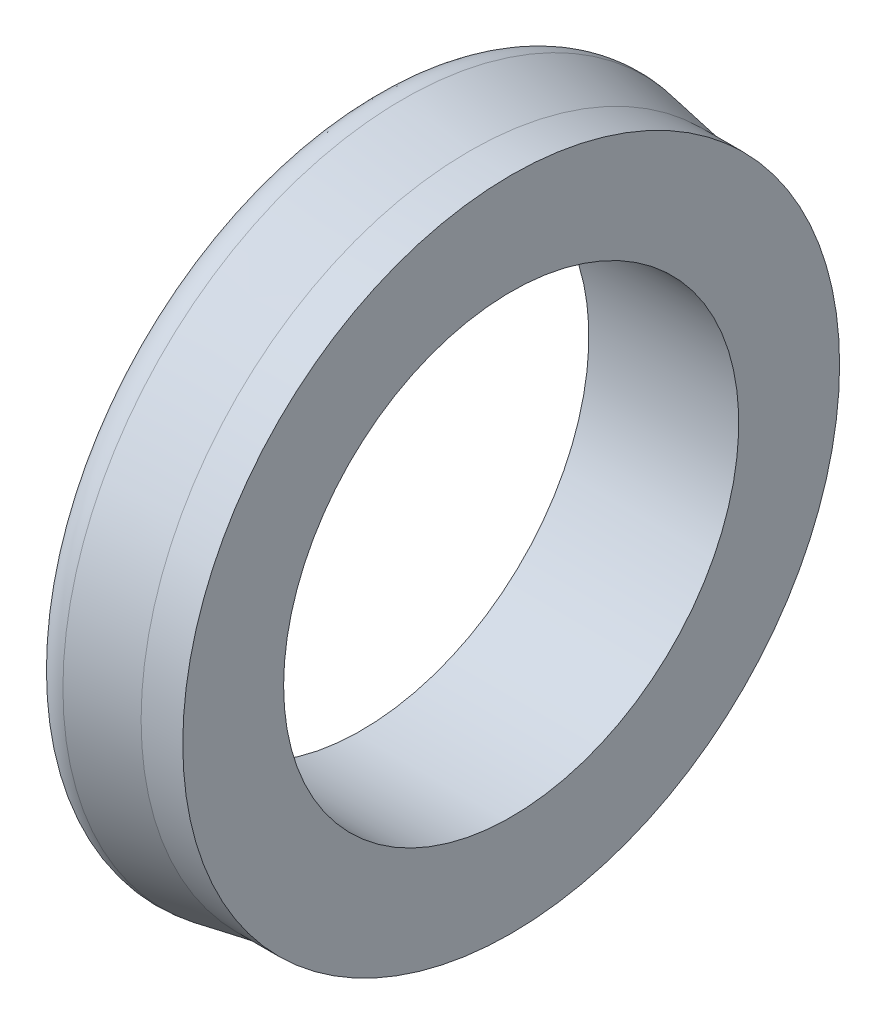
ISO-10303-21;
HEADER;
FILE_DESCRIPTION(('STEP AP214'),'2;1');
FILE_NAME('part.step','',(''),(''),'','','');
FILE_SCHEMA(('AUTOMOTIVE_DESIGN { 1 0 10303 214 1 1 1 1 }'));
ENDSEC;
DATA;
#1=APPLICATION_CONTEXT('core data for automotive mechanical design processes');
#2=APPLICATION_PROTOCOL_DEFINITION('international standard','automotive_design',2000,#1);
#3=PRODUCT_CONTEXT('',#1,'mechanical');
#4=PRODUCT('Part','Part','',(#3));
#5=PRODUCT_RELATED_PRODUCT_CATEGORY('part','',(#4));
#6=PRODUCT_DEFINITION_FORMATION('','',#4);
#7=PRODUCT_DEFINITION_CONTEXT('part definition',#1,'design');
#8=PRODUCT_DEFINITION('design','',#6,#7);
#9=PRODUCT_DEFINITION_SHAPE('','',#8);
#10=(LENGTH_UNIT() NAMED_UNIT(*) SI_UNIT(.MILLI.,.METRE.));
#11=(NAMED_UNIT(*) PLANE_ANGLE_UNIT() SI_UNIT($,.RADIAN.));
#12=(NAMED_UNIT(*) SI_UNIT($,.STERADIAN.) SOLID_ANGLE_UNIT());
#13=UNCERTAINTY_MEASURE_WITH_UNIT(LENGTH_MEASURE(1.E-05),#10,'distance_accuracy_value','');
#14=(GEOMETRIC_REPRESENTATION_CONTEXT(3) GLOBAL_UNCERTAINTY_ASSIGNED_CONTEXT((#13)) GLOBAL_UNIT_ASSIGNED_CONTEXT((#10,
#11,#12)) REPRESENTATION_CONTEXT('',''));
#15=CARTESIAN_POINT('',(0.,0.,0.));
#16=DIRECTION('',(0.,0.,1.));
#17=DIRECTION('',(1.,0.,0.));
#18=AXIS2_PLACEMENT_3D('',#15,#16,#17);
#19=CARTESIAN_POINT('',(0.,8.35,0.));
#20=DIRECTION('',(1.,0.,0.));
#21=DIRECTION('',(0.,0.,-1.));
#22=AXIS2_PLACEMENT_3D('',#19,#20,#21);
#23=PLANE('',#22);
#24=CARTESIAN_POINT('',(0.,0.,0.));
#25=DIRECTION('',(-1.,0.,0.));
#26=DIRECTION('',(0.,0.,1.));
#27=AXIS2_PLACEMENT_3D('',#24,#25,#26);
#28=CIRCLE('',#27,8.35);
#29=CARTESIAN_POINT('',(0.,0.,8.35));
#30=VERTEX_POINT('',#29);
#31=EDGE_CURVE('E10',#30,#30,#28,.T.);
#32=ORIENTED_EDGE('',*,*,#31,.F.);
#33=EDGE_LOOP('',(#32));
#34=FACE_BOUND('',#33,.T.);
#35=CARTESIAN_POINT('',(0.,0.,0.));
#36=DIRECTION('',(-1.,0.,0.));
#37=DIRECTION('',(0.,0.,1.));
#38=AXIS2_PLACEMENT_3D('',#35,#36,#37);
#39=CIRCLE('',#38,10.15);
#40=CARTESIAN_POINT('',(0.,0.,10.15));
#41=VERTEX_POINT('',#40);
#42=EDGE_CURVE('E62',#41,#41,#39,.T.);
#43=ORIENTED_EDGE('',*,*,#42,.T.);
#44=EDGE_LOOP('',(#43));
#45=FACE_BOUND('',#44,.T.);
#46=ADVANCED_FACE('F28',(#34,#45),#23,.F.);
#47=CARTESIAN_POINT('',(-5.,0.,0.));
#48=DIRECTION('',(-1.,0.,0.));
#49=DIRECTION('',(0.,0.,1.));
#50=AXIS2_PLACEMENT_3D('',#47,#48,#49);
#51=CYLINDRICAL_SURFACE('',#50,8.35);
#52=CARTESIAN_POINT('',(5.5,0.,0.));
#53=DIRECTION('',(-1.,0.,0.));
#54=DIRECTION('',(0.,0.,1.));
#55=AXIS2_PLACEMENT_3D('',#52,#53,#54);
#56=CIRCLE('',#55,8.35);
#57=CARTESIAN_POINT('',(5.5,0.,8.35));
#58=VERTEX_POINT('',#57);
#59=EDGE_CURVE('E34',#58,#58,#56,.T.);
#60=ORIENTED_EDGE('',*,*,#59,.F.);
#61=EDGE_LOOP('',(#60));
#62=FACE_BOUND('',#61,.T.);
#63=ORIENTED_EDGE('',*,*,#31,.T.);
#64=EDGE_LOOP('',(#63));
#65=FACE_BOUND('',#64,.T.);
#66=ADVANCED_FACE('F111',(#62,#65),#51,.F.);
#67=CARTESIAN_POINT('',(5.5,8.35,0.));
#68=DIRECTION('',(-1.,0.,0.));
#69=DIRECTION('',(0.,0.,1.));
#70=AXIS2_PLACEMENT_3D('',#67,#68,#69);
#71=PLANE('',#70);
#72=CARTESIAN_POINT('',(5.5,0.,0.));
#73=DIRECTION('',(-1.,0.,0.));
#74=DIRECTION('',(0.,0.,1.));
#75=AXIS2_PLACEMENT_3D('',#72,#73,#74);
#76=CIRCLE('',#75,12.05);
#77=CARTESIAN_POINT('',(5.5,0.,12.05));
#78=VERTEX_POINT('',#77);
#79=EDGE_CURVE('E38',#78,#78,#76,.T.);
#80=ORIENTED_EDGE('',*,*,#79,.F.);
#81=EDGE_LOOP('',(#80));
#82=FACE_BOUND('',#81,.T.);
#83=ORIENTED_EDGE('',*,*,#59,.T.);
#84=EDGE_LOOP('',(#83));
#85=FACE_BOUND('',#84,.T.);
#86=ADVANCED_FACE('F106',(#82,#85),#71,.F.);
#87=CARTESIAN_POINT('',(-5.,0.,0.));
#88=DIRECTION('',(-1.,0.,0.));
#89=DIRECTION('',(0.,0.,1.));
#90=AXIS2_PLACEMENT_3D('',#87,#88,#89);
#91=CYLINDRICAL_SURFACE('',#90,12.05);
#92=CARTESIAN_POINT('',(3.97133627049761,0.,0.));
#93=DIRECTION('',(-1.,0.,0.));
#94=DIRECTION('',(0.,0.,1.));
#95=AXIS2_PLACEMENT_3D('',#92,#93,#94);
#96=CIRCLE('',#95,12.05);
#97=CARTESIAN_POINT('',(3.97133627049761,0.,12.05));
#98=VERTEX_POINT('',#97);
#99=EDGE_CURVE('E42',#98,#98,#96,.T.);
#100=ORIENTED_EDGE('',*,*,#99,.F.);
#101=EDGE_LOOP('',(#100));
#102=FACE_BOUND('',#101,.T.);
#103=ORIENTED_EDGE('',*,*,#79,.T.);
#104=EDGE_LOOP('',(#103));
#105=FACE_BOUND('',#104,.T.);
#106=ADVANCED_FACE('F100',(#102,#105),#91,.T.);
#107=CARTESIAN_POINT('',(3.97133627049761,0.,0.));
#108=DIRECTION('',(-1.,0.,0.));
#109=DIRECTION('',(0.,0.,1.));
#110=AXIS2_PLACEMENT_3D('',#107,#108,#109);
#111=CONICAL_SURFACE('',#110,12.05,0.176576889836121);
#112=CARTESIAN_POINT('',(1.53655532192728,0.,0.));
#113=DIRECTION('',(-1.,0.,0.));
#114=DIRECTION('',(0.,0.,1.));
#115=AXIS2_PLACEMENT_3D('',#112,#113,#114);
#116=CIRCLE('',#115,12.484450765365);
#117=CARTESIAN_POINT('',(1.53655532192728,0.,12.484450765365));
#118=VERTEX_POINT('',#117);
#119=EDGE_CURVE('E47',#118,#118,#116,.T.);
#120=ORIENTED_EDGE('',*,*,#119,.F.);
#121=EDGE_LOOP('',(#120));
#122=FACE_BOUND('',#121,.T.);
#123=ORIENTED_EDGE('',*,*,#99,.T.);
#124=EDGE_LOOP('',(#123));
#125=FACE_BOUND('',#124,.T.);
#126=ADVANCED_FACE('F94',(#122,#125),#111,.T.);
#127=CARTESIAN_POINT('',(1.36089459617366,0.,0.));
#128=DIRECTION('',(-1.,0.,0.));
#129=DIRECTION('',(0.,0.,1.));
#130=AXIS2_PLACEMENT_3D('',#127,#128,#129);
#131=TOROIDAL_SURFACE('',#130,11.5,1.);
#132=CARTESIAN_POINT('',(0.599999999999999,0.,0.));
#133=DIRECTION('',(-1.,0.,0.));
#134=DIRECTION('',(0.,0.,1.));
#135=AXIS2_PLACEMENT_3D('',#132,#133,#134);
#136=CIRCLE('',#135,12.1488754992398);
#137=CARTESIAN_POINT('',(0.599999999999999,0.,12.1488754992398));
#138=VERTEX_POINT('',#137);
#139=EDGE_CURVE('E50',#138,#138,#136,.T.);
#140=ORIENTED_EDGE('',*,*,#139,.F.);
#141=EDGE_LOOP('',(#140));
#142=FACE_BOUND('',#141,.T.);
#143=ORIENTED_EDGE('',*,*,#119,.T.);
#144=EDGE_LOOP('',(#143));
#145=FACE_BOUND('',#144,.T.);
#146=ADVANCED_FACE('F88',(#142,#145),#131,.T.);
#147=CARTESIAN_POINT('',(0.599999999999999,0.,0.));
#148=DIRECTION('',(1.,0.,0.));
#149=DIRECTION('',(0.,0.,-1.));
#150=AXIS2_PLACEMENT_3D('',#147,#148,#149);
#151=CONICAL_SURFACE('',#150,12.1488754992398,1.44644133224814);
#152=CARTESIAN_POINT('',(0.5,0.,0.));
#153=DIRECTION('',(-1.,0.,0.));
#154=DIRECTION('',(0.,0.,1.));
#155=AXIS2_PLACEMENT_3D('',#152,#153,#154);
#156=CIRCLE('',#155,11.3488754992398);
#157=CARTESIAN_POINT('',(0.5,0.,11.3488754992398));
#158=VERTEX_POINT('',#157);
#159=EDGE_CURVE('E53',#158,#158,#156,.T.);
#160=ORIENTED_EDGE('',*,*,#159,.F.);
#161=EDGE_LOOP('',(#160));
#162=FACE_BOUND('',#161,.T.);
#163=ORIENTED_EDGE('',*,*,#139,.T.);
#164=EDGE_LOOP('',(#163));
#165=FACE_BOUND('',#164,.T.);
#166=ADVANCED_FACE('F82',(#162,#165),#151,.T.);
#167=CARTESIAN_POINT('',(0.5,0.,0.));
#168=DIRECTION('',(-1.,0.,0.));
#169=DIRECTION('',(0.,0.,1.));
#170=AXIS2_PLACEMENT_3D('',#167,#168,#169);
#171=CONICAL_SURFACE('',#170,11.3488754992398,0.17657688983612);
#172=CARTESIAN_POINT('',(2.77026429030145,0.,0.));
#173=DIRECTION('',(-1.,0.,0.));
#174=DIRECTION('',(0.,0.,1.));
#175=AXIS2_PLACEMENT_3D('',#172,#173,#174);
#176=CIRCLE('',#175,10.943780306146);
#177=CARTESIAN_POINT('',(2.77026429030145,0.,10.943780306146));
#178=VERTEX_POINT('',#177);
#179=EDGE_CURVE('E56',#178,#178,#176,.T.);
#180=ORIENTED_EDGE('',*,*,#179,.F.);
#181=EDGE_LOOP('',(#180));
#182=FACE_BOUND('',#181,.T.);
#183=ORIENTED_EDGE('',*,*,#159,.T.);
#184=EDGE_LOOP('',(#183));
#185=FACE_BOUND('',#184,.T.);
#186=ADVANCED_FACE('F76',(#182,#185),#171,.F.);
#187=CARTESIAN_POINT('',(2.7,0.,0.));
#188=DIRECTION('',(-1.,0.,0.));
#189=DIRECTION('',(0.,0.,1.));
#190=AXIS2_PLACEMENT_3D('',#187,#188,#189);
#191=TOROIDAL_SURFACE('',#190,10.55,0.400000000000001);
#192=CARTESIAN_POINT('',(2.7,0.,0.));
#193=DIRECTION('',(-1.,0.,0.));
#194=DIRECTION('',(0.,0.,1.));
#195=AXIS2_PLACEMENT_3D('',#192,#193,#194);
#196=CIRCLE('',#195,10.15);
#197=CARTESIAN_POINT('',(2.7,0.,10.15));
#198=VERTEX_POINT('',#197);
#199=EDGE_CURVE('E59',#198,#198,#196,.T.);
#200=ORIENTED_EDGE('',*,*,#199,.F.);
#201=EDGE_LOOP('',(#200));
#202=FACE_BOUND('',#201,.T.);
#203=ORIENTED_EDGE('',*,*,#179,.T.);
#204=EDGE_LOOP('',(#203));
#205=FACE_BOUND('',#204,.T.);
#206=ADVANCED_FACE('F70',(#202,#205),#191,.F.);
#207=CARTESIAN_POINT('',(-5.,0.,0.));
#208=DIRECTION('',(-1.,0.,0.));
#209=DIRECTION('',(0.,0.,1.));
#210=AXIS2_PLACEMENT_3D('',#207,#208,#209);
#211=CYLINDRICAL_SURFACE('',#210,10.15);
#212=ORIENTED_EDGE('',*,*,#42,.F.);
#213=EDGE_LOOP('',(#212));
#214=FACE_BOUND('',#213,.T.);
#215=ORIENTED_EDGE('',*,*,#199,.T.);
#216=EDGE_LOOP('',(#215));
#217=FACE_BOUND('',#216,.T.);
#218=ADVANCED_FACE('F67',(#214,#217),#211,.T.);
#219=CLOSED_SHELL('',(#46,#66,#86,#106,#126,#146,#166,#186,#206,#218));
#220=MANIFOLD_SOLID_BREP('B2',#219);
#221=ADVANCED_BREP_SHAPE_REPRESENTATION('',(#18,#220),#14);
#222=SHAPE_DEFINITION_REPRESENTATION(#9,#221);
ENDSEC;
END-ISO-10303-21;
